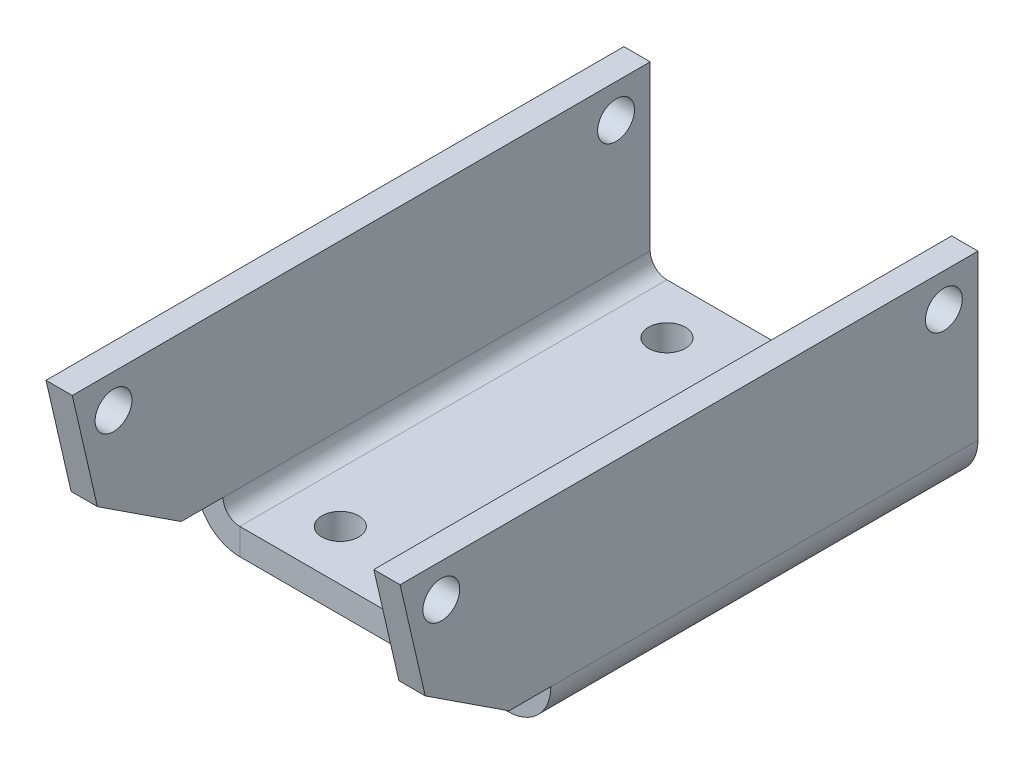
ISO-10303-21;
HEADER;
FILE_DESCRIPTION(('STEP AP214'),'2;1');
FILE_NAME('part.step','',(''),(''),'','','');
FILE_SCHEMA(('AUTOMOTIVE_DESIGN { 1 0 10303 214 1 1 1 1 }'));
ENDSEC;
DATA;
#1=APPLICATION_CONTEXT('core data for automotive mechanical design processes');
#2=APPLICATION_PROTOCOL_DEFINITION('international standard','automotive_design',2000,#1);
#3=PRODUCT_CONTEXT('',#1,'mechanical');
#4=PRODUCT('Part','Part','',(#3));
#5=PRODUCT_RELATED_PRODUCT_CATEGORY('part','',(#4));
#6=PRODUCT_DEFINITION_FORMATION('','',#4);
#7=PRODUCT_DEFINITION_CONTEXT('part definition',#1,'design');
#8=PRODUCT_DEFINITION('design','',#6,#7);
#9=PRODUCT_DEFINITION_SHAPE('','',#8);
#10=(LENGTH_UNIT() NAMED_UNIT(*) SI_UNIT(.MILLI.,.METRE.));
#11=(NAMED_UNIT(*) PLANE_ANGLE_UNIT() SI_UNIT($,.RADIAN.));
#12=(NAMED_UNIT(*) SI_UNIT($,.STERADIAN.) SOLID_ANGLE_UNIT());
#13=UNCERTAINTY_MEASURE_WITH_UNIT(LENGTH_MEASURE(1.E-05),#10,'distance_accuracy_value','');
#14=(GEOMETRIC_REPRESENTATION_CONTEXT(3) GLOBAL_UNCERTAINTY_ASSIGNED_CONTEXT((#13)) GLOBAL_UNIT_ASSIGNED_CONTEXT((#10,
#11,#12)) REPRESENTATION_CONTEXT('',''));
#15=CARTESIAN_POINT('',(0.,0.,0.));
#16=DIRECTION('',(0.,0.,1.));
#17=DIRECTION('',(1.,0.,0.));
#18=AXIS2_PLACEMENT_3D('',#15,#16,#17);
#19=CARTESIAN_POINT('',(-10.57,0.,0.));
#20=DIRECTION('',(-1.,0.,0.));
#21=DIRECTION('',(0.,-1.,0.));
#22=AXIS2_PLACEMENT_3D('',#19,#20,#21);
#23=PLANE('',#22);
#24=CARTESIAN_POINT('',(-10.57,8.77000000000008,-10.7115384615385));
#25=DIRECTION('',(1.,0.,0.));
#26=DIRECTION('',(0.,1.,0.));
#27=AXIS2_PLACEMENT_3D('',#24,#25,#26);
#28=CIRCLE('',#27,1.1);
#29=CARTESIAN_POINT('',(-10.57,9.87000000000008,-10.7115384615385));
#30=VERTEX_POINT('',#29);
#31=EDGE_CURVE('E872',#30,#30,#28,.T.);
#32=ORIENTED_EDGE('',*,*,#31,.T.);
#33=EDGE_LOOP('',(#32));
#34=FACE_BOUND('',#33,.T.);
#35=CARTESIAN_POINT('',(-10.57,8.77000000000008,19.2884615384615));
#36=DIRECTION('',(1.,0.,0.));
#37=DIRECTION('',(0.,1.,0.));
#38=AXIS2_PLACEMENT_3D('',#35,#36,#37);
#39=CIRCLE('',#38,1.1);
#40=CARTESIAN_POINT('',(-10.57,9.87000000000008,19.2884615384615));
#41=VERTEX_POINT('',#40);
#42=EDGE_CURVE('E201',#41,#41,#39,.T.);
#43=ORIENTED_EDGE('',*,*,#42,.T.);
#44=EDGE_LOOP('',(#43));
#45=FACE_BOUND('',#44,.T.);
#46=DIRECTION('',(0.,0.547339555355365,0.836910635099944));
#47=VECTOR('',#46,1.);
#48=CARTESIAN_POINT('',(-10.57,-6.28521358589521,4.11052968517546));
#49=LINE('',#48,#47);
#50=CARTESIAN_POINT('',(-10.57,1.00000000000005,15.25));
#51=VERTEX_POINT('',#50);
#52=CARTESIAN_POINT('',(-10.57,4.27000000000006,20.25));
#53=VERTEX_POINT('',#52);
#54=EDGE_CURVE('E222',#51,#53,#49,.T.);
#55=ORIENTED_EDGE('',*,*,#54,.T.);
#56=DIRECTION('',(0.,0.97439119569462,0.224859506698758));
#57=VECTOR('',#56,1.);
#58=CARTESIAN_POINT('',(-10.57,-4.22089887640452,18.2905617977528));
#59=LINE('',#58,#57);
#60=CARTESIAN_POINT('',(-10.57,10.77,21.75));
#61=VERTEX_POINT('',#60);
#62=EDGE_CURVE('E218',#53,#61,#59,.T.);
#63=ORIENTED_EDGE('',*,*,#62,.T.);
#64=DIRECTION('',(0.,0.,1.));
#65=VECTOR('',#64,1.);
#66=CARTESIAN_POINT('',(-10.57,10.77,12.75));
#67=LINE('',#66,#65);
#68=CARTESIAN_POINT('',(-10.57,10.77,-12.75));
#69=VERTEX_POINT('',#68);
#70=EDGE_CURVE('E276',#69,#61,#67,.T.);
#71=ORIENTED_EDGE('',*,*,#70,.F.);
#72=DIRECTION('',(0.,1.,0.));
#73=VECTOR('',#72,1.);
#74=CARTESIAN_POINT('',(-10.57,10.77,-12.75));
#75=LINE('',#74,#73);
#76=CARTESIAN_POINT('',(-10.57,0.999999999999991,-12.75));
#77=VERTEX_POINT('',#76);
#78=EDGE_CURVE('E279',#77,#69,#75,.T.);
#79=ORIENTED_EDGE('',*,*,#78,.F.);
#80=DIRECTION('',(0.,0.,1.));
#81=VECTOR('',#80,1.);
#82=CARTESIAN_POINT('',(-10.57,0.999999999999991,0.));
#83=LINE('',#82,#81);
#84=CARTESIAN_POINT('',(-10.57,0.999999999999991,12.75));
#85=VERTEX_POINT('',#84);
#86=EDGE_CURVE('E288',#77,#85,#83,.T.);
#87=ORIENTED_EDGE('',*,*,#86,.T.);
#88=DIRECTION('',(0.,0.,-1.));
#89=VECTOR('',#88,1.);
#90=CARTESIAN_POINT('',(-10.57,0.999999999999991,21.75));
#91=LINE('',#90,#89);
#92=EDGE_CURVE('E268',#51,#85,#91,.T.);
#93=ORIENTED_EDGE('',*,*,#92,.F.);
#94=EDGE_LOOP('',(#55,#63,#71,#79,#87,#93));
#95=FACE_BOUND('',#94,.T.);
#96=ADVANCED_FACE('F79',(#34,#45,#95),#23,.T.);
#97=CARTESIAN_POINT('',(-9.,0.,0.));
#98=DIRECTION('',(-1.,0.,0.));
#99=DIRECTION('',(0.,-1.,0.));
#100=AXIS2_PLACEMENT_3D('',#97,#98,#99);
#101=PLANE('',#100);
#102=CARTESIAN_POINT('',(-9.00000000000003,8.77000000000007,-10.7115384615385));
#103=DIRECTION('',(-1.,0.,0.));
#104=DIRECTION('',(0.,-1.,0.));
#105=AXIS2_PLACEMENT_3D('',#102,#103,#104);
#106=CIRCLE('',#105,1.1);
#107=CARTESIAN_POINT('',(-9.00000000000002,7.67000000000007,-10.7115384615385));
#108=VERTEX_POINT('',#107);
#109=EDGE_CURVE('E213',#108,#108,#106,.T.);
#110=ORIENTED_EDGE('',*,*,#109,.T.);
#111=EDGE_LOOP('',(#110));
#112=FACE_BOUND('',#111,.T.);
#113=CARTESIAN_POINT('',(-9.00000000000003,8.77000000000007,19.2884615384615));
#114=DIRECTION('',(-1.,0.,0.));
#115=DIRECTION('',(0.,-1.,0.));
#116=AXIS2_PLACEMENT_3D('',#113,#114,#115);
#117=CIRCLE('',#116,1.1);
#118=CARTESIAN_POINT('',(-9.00000000000002,7.67000000000007,19.2884615384615));
#119=VERTEX_POINT('',#118);
#120=EDGE_CURVE('E200',#119,#119,#117,.T.);
#121=ORIENTED_EDGE('',*,*,#120,.T.);
#122=EDGE_LOOP('',(#121));
#123=FACE_BOUND('',#122,.T.);
#124=DIRECTION('',(0.,0.97439119569462,0.224859506698758));
#125=VECTOR('',#124,1.);
#126=CARTESIAN_POINT('',(-8.99999999999998,-4.22089887640452,18.2905617977528));
#127=LINE('',#126,#125);
#128=CARTESIAN_POINT('',(-9.00000000000002,4.27000000000007,20.25));
#129=VERTEX_POINT('',#128);
#130=CARTESIAN_POINT('',(-9.00000000000004,10.77,21.75));
#131=VERTEX_POINT('',#130);
#132=EDGE_CURVE('E225',#129,#131,#127,.T.);
#133=ORIENTED_EDGE('',*,*,#132,.F.);
#134=DIRECTION('',(0.,0.547339555355365,0.836910635099944));
#135=VECTOR('',#134,1.);
#136=CARTESIAN_POINT('',(-8.99999999999998,-6.28521358589521,4.11052968517546));
#137=LINE('',#136,#135);
#138=CARTESIAN_POINT('',(-9.,1.00000000000006,15.25));
#139=VERTEX_POINT('',#138);
#140=EDGE_CURVE('E205',#139,#129,#137,.T.);
#141=ORIENTED_EDGE('',*,*,#140,.F.);
#142=DIRECTION('',(0.,0.,-1.));
#143=VECTOR('',#142,1.);
#144=CARTESIAN_POINT('',(-9.,0.999999999999997,21.75));
#145=LINE('',#144,#143);
#146=CARTESIAN_POINT('',(-9.,0.999999999999997,12.75));
#147=VERTEX_POINT('',#146);
#148=EDGE_CURVE('E265',#139,#147,#145,.T.);
#149=ORIENTED_EDGE('',*,*,#148,.T.);
#150=DIRECTION('',(0.,0.,-1.));
#151=VECTOR('',#150,1.);
#152=CARTESIAN_POINT('',(-9.,0.999999999999997,-12.75));
#153=LINE('',#152,#151);
#154=CARTESIAN_POINT('',(-9.,0.999999999999997,-12.75));
#155=VERTEX_POINT('',#154);
#156=EDGE_CURVE('E294',#155,#147,#153,.F.);
#157=ORIENTED_EDGE('',*,*,#156,.F.);
#158=DIRECTION('',(0.,-1.,0.));
#159=VECTOR('',#158,1.);
#160=CARTESIAN_POINT('',(-9.,0.,-12.75));
#161=LINE('',#160,#159);
#162=CARTESIAN_POINT('',(-9.00000000000004,10.77,-12.75));
#163=VERTEX_POINT('',#162);
#164=EDGE_CURVE('E285',#155,#163,#161,.F.);
#165=ORIENTED_EDGE('',*,*,#164,.T.);
#166=DIRECTION('',(0.,0.,-1.));
#167=VECTOR('',#166,1.);
#168=CARTESIAN_POINT('',(-9.00000000000004,10.77,0.));
#169=LINE('',#168,#167);
#170=EDGE_CURVE('E282',#163,#131,#169,.F.);
#171=ORIENTED_EDGE('',*,*,#170,.T.);
#172=EDGE_LOOP('',(#133,#141,#149,#157,#165,#171));
#173=FACE_BOUND('',#172,.T.);
#174=ADVANCED_FACE('F416',(#112,#123,#173),#101,.F.);
#175=CARTESIAN_POINT('',(-10.57,0.999999999999991,21.75));
#176=DIRECTION('',(0.,1.,0.));
#177=DIRECTION('',(-1.,0.,0.));
#178=AXIS2_PLACEMENT_3D('',#175,#176,#177);
#179=PLANE('',#178);
#180=DIRECTION('',(1.,0.,0.));
#181=VECTOR('',#180,1.);
#182=CARTESIAN_POINT('',(-9.,1.00000000000006,15.25));
#183=LINE('',#182,#181);
#184=EDGE_CURVE('E221',#139,#51,#183,.F.);
#185=ORIENTED_EDGE('',*,*,#184,.T.);
#186=ORIENTED_EDGE('',*,*,#92,.T.);
#187=DIRECTION('',(-1.,0.,0.));
#188=VECTOR('',#187,1.);
#189=CARTESIAN_POINT('',(-9.,0.999999999999997,12.75));
#190=LINE('',#189,#188);
#191=EDGE_CURVE('E291',#147,#85,#190,.T.);
#192=ORIENTED_EDGE('',*,*,#191,.F.);
#193=ORIENTED_EDGE('',*,*,#148,.F.);
#194=EDGE_LOOP('',(#185,#186,#192,#193));
#195=FACE_BOUND('',#194,.T.);
#196=ADVANCED_FACE('F422',(#195),#179,.F.);
#197=CARTESIAN_POINT('',(10.57,0.,0.));
#198=DIRECTION('',(-1.,0.,0.));
#199=DIRECTION('',(0.,-1.,0.));
#200=AXIS2_PLACEMENT_3D('',#197,#198,#199);
#201=PLANE('',#200);
#202=CARTESIAN_POINT('',(10.57,8.77,-10.7115384615385));
#203=DIRECTION('',(1.,0.,0.));
#204=DIRECTION('',(0.,1.,0.));
#205=AXIS2_PLACEMENT_3D('',#202,#203,#204);
#206=CIRCLE('',#205,1.1);
#207=CARTESIAN_POINT('',(10.57,9.87,-10.7115384615385));
#208=VERTEX_POINT('',#207);
#209=EDGE_CURVE('E877',#208,#208,#206,.T.);
#210=ORIENTED_EDGE('',*,*,#209,.F.);
#211=EDGE_LOOP('',(#210));
#212=FACE_BOUND('',#211,.T.);
#213=CARTESIAN_POINT('',(10.57,8.77,19.2884615384615));
#214=DIRECTION('',(1.,0.,0.));
#215=DIRECTION('',(0.,1.,0.));
#216=AXIS2_PLACEMENT_3D('',#213,#214,#215);
#217=CIRCLE('',#216,1.1);
#218=CARTESIAN_POINT('',(10.57,9.87,19.2884615384615));
#219=VERTEX_POINT('',#218);
#220=EDGE_CURVE('E208',#219,#219,#217,.T.);
#221=ORIENTED_EDGE('',*,*,#220,.F.);
#222=EDGE_LOOP('',(#221));
#223=FACE_BOUND('',#222,.T.);
#224=DIRECTION('',(0.,0.97439119569462,0.224859506698758));
#225=VECTOR('',#224,1.);
#226=CARTESIAN_POINT('',(10.57,-4.22089887640452,18.2905617977528));
#227=LINE('',#226,#225);
#228=CARTESIAN_POINT('',(10.57,4.27,20.25));
#229=VERTEX_POINT('',#228);
#230=CARTESIAN_POINT('',(10.57,10.77,21.75));
#231=VERTEX_POINT('',#230);
#232=EDGE_CURVE('E236',#229,#231,#227,.T.);
#233=ORIENTED_EDGE('',*,*,#232,.F.);
#234=DIRECTION('',(0.,0.547339555355365,0.836910635099944));
#235=VECTOR('',#234,1.);
#236=CARTESIAN_POINT('',(10.57,-6.28521358589526,4.11052968517548));
#237=LINE('',#236,#235);
#238=CARTESIAN_POINT('',(10.57,0.999999999999991,15.25));
#239=VERTEX_POINT('',#238);
#240=EDGE_CURVE('E239',#239,#229,#237,.T.);
#241=ORIENTED_EDGE('',*,*,#240,.F.);
#242=DIRECTION('',(0.,0.,-1.));
#243=VECTOR('',#242,1.);
#244=CARTESIAN_POINT('',(10.57,0.999999999999991,21.75));
#245=LINE('',#244,#243);
#246=CARTESIAN_POINT('',(10.57,0.999999999999991,12.75));
#247=VERTEX_POINT('',#246);
#248=EDGE_CURVE('E256',#239,#247,#245,.T.);
#249=ORIENTED_EDGE('',*,*,#248,.T.);
#250=DIRECTION('',(0.,0.,-1.));
#251=VECTOR('',#250,1.);
#252=CARTESIAN_POINT('',(10.57,0.999999999999991,12.75));
#253=LINE('',#252,#251);
#254=CARTESIAN_POINT('',(10.57,0.999999999999991,-12.75));
#255=VERTEX_POINT('',#254);
#256=EDGE_CURVE('E324',#255,#247,#253,.F.);
#257=ORIENTED_EDGE('',*,*,#256,.F.);
#258=DIRECTION('',(0.,1.,0.));
#259=VECTOR('',#258,1.);
#260=CARTESIAN_POINT('',(10.57,0.,-12.75));
#261=LINE('',#260,#259);
#262=CARTESIAN_POINT('',(10.57,10.77,-12.75));
#263=VERTEX_POINT('',#262);
#264=EDGE_CURVE('E315',#255,#263,#261,.T.);
#265=ORIENTED_EDGE('',*,*,#264,.T.);
#266=DIRECTION('',(0.,0.,1.));
#267=VECTOR('',#266,1.);
#268=CARTESIAN_POINT('',(10.57,10.77,0.));
#269=LINE('',#268,#267);
#270=EDGE_CURVE('E312',#263,#231,#269,.T.);
#271=ORIENTED_EDGE('',*,*,#270,.T.);
#272=EDGE_LOOP('',(#233,#241,#249,#257,#265,#271));
#273=FACE_BOUND('',#272,.T.);
#274=ADVANCED_FACE('F403',(#212,#223,#273),#201,.F.);
#275=CARTESIAN_POINT('',(9.,0.,0.));
#276=DIRECTION('',(-1.,0.,0.));
#277=DIRECTION('',(0.,-1.,0.));
#278=AXIS2_PLACEMENT_3D('',#275,#276,#277);
#279=PLANE('',#278);
#280=CARTESIAN_POINT('',(9.00000000000003,8.77000000000001,-10.7115384615385));
#281=DIRECTION('',(-1.,0.,0.));
#282=DIRECTION('',(0.,-1.,0.));
#283=AXIS2_PLACEMENT_3D('',#280,#281,#282);
#284=CIRCLE('',#283,1.1);
#285=CARTESIAN_POINT('',(9.00000000000002,7.67000000000001,-10.7115384615385));
#286=VERTEX_POINT('',#285);
#287=EDGE_CURVE('E83',#286,#286,#284,.T.);
#288=ORIENTED_EDGE('',*,*,#287,.F.);
#289=EDGE_LOOP('',(#288));
#290=FACE_BOUND('',#289,.T.);
#291=CARTESIAN_POINT('',(9.00000000000003,8.77000000000001,19.2884615384615));
#292=DIRECTION('',(-1.,0.,0.));
#293=DIRECTION('',(0.,-1.,0.));
#294=AXIS2_PLACEMENT_3D('',#291,#292,#293);
#295=CIRCLE('',#294,1.1);
#296=CARTESIAN_POINT('',(9.00000000000002,7.67000000000001,19.2884615384615));
#297=VERTEX_POINT('',#296);
#298=EDGE_CURVE('E198',#297,#297,#295,.T.);
#299=ORIENTED_EDGE('',*,*,#298,.F.);
#300=EDGE_LOOP('',(#299));
#301=FACE_BOUND('',#300,.T.);
#302=DIRECTION('',(0.,0.547339555355365,0.836910635099944));
#303=VECTOR('',#302,1.);
#304=CARTESIAN_POINT('',(8.99999999999998,-6.28521358589525,4.11052968517548));
#305=LINE('',#304,#303);
#306=CARTESIAN_POINT('',(9.,0.999999999999996,15.25));
#307=VERTEX_POINT('',#306);
#308=CARTESIAN_POINT('',(9.00000000000002,4.27000000000001,20.25));
#309=VERTEX_POINT('',#308);
#310=EDGE_CURVE('E240',#307,#309,#305,.T.);
#311=ORIENTED_EDGE('',*,*,#310,.T.);
#312=DIRECTION('',(0.,0.97439119569462,0.224859506698758));
#313=VECTOR('',#312,1.);
#314=CARTESIAN_POINT('',(8.99999999999998,-4.22089887640452,18.2905617977528));
#315=LINE('',#314,#313);
#316=CARTESIAN_POINT('',(9.00000000000004,10.77,21.75));
#317=VERTEX_POINT('',#316);
#318=EDGE_CURVE('E233',#309,#317,#315,.T.);
#319=ORIENTED_EDGE('',*,*,#318,.T.);
#320=DIRECTION('',(0.,0.,-1.));
#321=VECTOR('',#320,1.);
#322=CARTESIAN_POINT('',(9.00000000000004,10.77,12.75));
#323=LINE('',#322,#321);
#324=CARTESIAN_POINT('',(9.00000000000004,10.77,-12.75));
#325=VERTEX_POINT('',#324);
#326=EDGE_CURVE('E318',#325,#317,#323,.F.);
#327=ORIENTED_EDGE('',*,*,#326,.F.);
#328=DIRECTION('',(0.,-1.,0.));
#329=VECTOR('',#328,1.);
#330=CARTESIAN_POINT('',(9.00000000000004,10.77,-12.75));
#331=LINE('',#330,#329);
#332=CARTESIAN_POINT('',(9.,0.999999999999997,-12.75));
#333=VERTEX_POINT('',#332);
#334=EDGE_CURVE('E321',#333,#325,#331,.F.);
#335=ORIENTED_EDGE('',*,*,#334,.F.);
#336=DIRECTION('',(0.,0.,-1.));
#337=VECTOR('',#336,1.);
#338=CARTESIAN_POINT('',(9.,0.999999999999997,12.75));
#339=LINE('',#338,#337);
#340=CARTESIAN_POINT('',(9.,0.999999999999997,12.75));
#341=VERTEX_POINT('',#340);
#342=EDGE_CURVE('E330',#341,#333,#339,.T.);
#343=ORIENTED_EDGE('',*,*,#342,.F.);
#344=DIRECTION('',(0.,0.,-1.));
#345=VECTOR('',#344,1.);
#346=CARTESIAN_POINT('',(9.,0.999999999999997,21.75));
#347=LINE('',#346,#345);
#348=EDGE_CURVE('E259',#307,#341,#347,.T.);
#349=ORIENTED_EDGE('',*,*,#348,.F.);
#350=EDGE_LOOP('',(#311,#319,#327,#335,#343,#349));
#351=FACE_BOUND('',#350,.T.);
#352=ADVANCED_FACE('F346',(#290,#301,#351),#279,.T.);
#353=CARTESIAN_POINT('',(10.57,0.999999999999991,21.75));
#354=DIRECTION('',(0.,1.,0.));
#355=DIRECTION('',(-1.,0.,0.));
#356=AXIS2_PLACEMENT_3D('',#353,#354,#355);
#357=PLANE('',#356);
#358=DIRECTION('',(-1.,0.,0.));
#359=VECTOR('',#358,1.);
#360=CARTESIAN_POINT('',(9.,0.999999999999996,15.25));
#361=LINE('',#360,#359);
#362=EDGE_CURVE('E248',#307,#239,#361,.F.);
#363=ORIENTED_EDGE('',*,*,#362,.F.);
#364=ORIENTED_EDGE('',*,*,#348,.T.);
#365=DIRECTION('',(-1.,0.,0.));
#366=VECTOR('',#365,1.);
#367=CARTESIAN_POINT('',(10.57,0.999999999999991,12.75));
#368=LINE('',#367,#366);
#369=EDGE_CURVE('E151',#341,#247,#368,.F.);
#370=ORIENTED_EDGE('',*,*,#369,.T.);
#371=ORIENTED_EDGE('',*,*,#248,.F.);
#372=EDGE_LOOP('',(#363,#364,#370,#371));
#373=FACE_BOUND('',#372,.T.);
#374=ADVANCED_FACE('F339',(#373),#357,.F.);
#375=CARTESIAN_POINT('',(-8.,-1.57,12.75));
#376=DIRECTION('',(0.,0.,1.));
#377=DIRECTION('',(1.,0.,0.));
#378=AXIS2_PLACEMENT_3D('',#375,#376,#377);
#379=PLANE('',#378);
#380=DIRECTION('',(1.,0.,0.));
#381=VECTOR('',#380,1.);
#382=CARTESIAN_POINT('',(-8.,0.,12.75));
#383=LINE('',#382,#381);
#384=CARTESIAN_POINT('',(-8.,0.,12.75));
#385=VERTEX_POINT('',#384);
#386=CARTESIAN_POINT('',(8.,0.,12.75));
#387=VERTEX_POINT('',#386);
#388=EDGE_CURVE('E122',#385,#387,#383,.T.);
#389=ORIENTED_EDGE('',*,*,#388,.F.);
#390=DIRECTION('',(0.,1.,0.));
#391=VECTOR('',#390,1.);
#392=CARTESIAN_POINT('',(-8.,-1.57,12.75));
#393=LINE('',#392,#391);
#394=CARTESIAN_POINT('',(-8.,-1.57,12.75));
#395=VERTEX_POINT('',#394);
#396=EDGE_CURVE('E89',#395,#385,#393,.T.);
#397=ORIENTED_EDGE('',*,*,#396,.F.);
#398=DIRECTION('',(1.,0.,0.));
#399=VECTOR('',#398,1.);
#400=CARTESIAN_POINT('',(-8.,-1.57,12.75));
#401=LINE('',#400,#399);
#402=CARTESIAN_POINT('',(8.,-1.57,12.75));
#403=VERTEX_POINT('',#402);
#404=EDGE_CURVE('E124',#395,#403,#401,.T.);
#405=ORIENTED_EDGE('',*,*,#404,.T.);
#406=DIRECTION('',(0.,1.,0.));
#407=VECTOR('',#406,1.);
#408=CARTESIAN_POINT('',(8.,-1.57,12.75));
#409=LINE('',#408,#407);
#410=EDGE_CURVE('E13',#403,#387,#409,.T.);
#411=ORIENTED_EDGE('',*,*,#410,.T.);
#412=EDGE_LOOP('',(#389,#397,#405,#411));
#413=FACE_BOUND('',#412,.T.);
#414=ADVANCED_FACE('F120',(#413),#379,.T.);
#415=CARTESIAN_POINT('',(-8.,-1.57,-12.75));
#416=DIRECTION('',(0.,0.,-1.));
#417=DIRECTION('',(-1.,0.,0.));
#418=AXIS2_PLACEMENT_3D('',#415,#416,#417);
#419=PLANE('',#418);
#420=DIRECTION('',(-1.,0.,0.));
#421=VECTOR('',#420,1.);
#422=CARTESIAN_POINT('',(-8.,0.,-12.75));
#423=LINE('',#422,#421);
#424=CARTESIAN_POINT('',(8.,0.,-12.75));
#425=VERTEX_POINT('',#424);
#426=CARTESIAN_POINT('',(-8.,0.,-12.75));
#427=VERTEX_POINT('',#426);
#428=EDGE_CURVE('E145',#425,#427,#423,.T.);
#429=ORIENTED_EDGE('',*,*,#428,.F.);
#430=DIRECTION('',(0.,1.,0.));
#431=VECTOR('',#430,1.);
#432=CARTESIAN_POINT('',(8.,-1.57,-12.75));
#433=LINE('',#432,#431);
#434=CARTESIAN_POINT('',(8.,-1.57,-12.75));
#435=VERTEX_POINT('',#434);
#436=EDGE_CURVE('E191',#435,#425,#433,.T.);
#437=ORIENTED_EDGE('',*,*,#436,.F.);
#438=DIRECTION('',(-1.,0.,0.));
#439=VECTOR('',#438,1.);
#440=CARTESIAN_POINT('',(-8.,-1.57,-12.75));
#441=LINE('',#440,#439);
#442=CARTESIAN_POINT('',(-8.,-1.57,-12.75));
#443=VERTEX_POINT('',#442);
#444=EDGE_CURVE('E185',#435,#443,#441,.T.);
#445=ORIENTED_EDGE('',*,*,#444,.T.);
#446=DIRECTION('',(0.,1.,0.));
#447=VECTOR('',#446,1.);
#448=CARTESIAN_POINT('',(-8.,-1.57,-12.75));
#449=LINE('',#448,#447);
#450=EDGE_CURVE('E196',#443,#427,#449,.T.);
#451=ORIENTED_EDGE('',*,*,#450,.T.);
#452=EDGE_LOOP('',(#429,#437,#445,#451));
#453=FACE_BOUND('',#452,.T.);
#454=ADVANCED_FACE('F81',(#453),#419,.T.);
#455=CARTESIAN_POINT('',(0.,-1.57,0.));
#456=DIRECTION('',(0.,-1.,0.));
#457=DIRECTION('',(0.,0.,-1.));
#458=AXIS2_PLACEMENT_3D('',#455,#456,#457);
#459=PLANE('',#458);
#460=CARTESIAN_POINT('',(5.,-1.57,9.75));
#461=DIRECTION('',(0.,1.,0.));
#462=DIRECTION('',(0.,0.,1.));
#463=AXIS2_PLACEMENT_3D('',#460,#461,#462);
#464=CIRCLE('',#463,1.1);
#465=CARTESIAN_POINT('',(5.,-1.57,10.85));
#466=VERTEX_POINT('',#465);
#467=EDGE_CURVE('E161',#466,#466,#464,.T.);
#468=ORIENTED_EDGE('',*,*,#467,.T.);
#469=EDGE_LOOP('',(#468));
#470=FACE_BOUND('',#469,.T.);
#471=CARTESIAN_POINT('',(-5.,-1.57,9.75));
#472=DIRECTION('',(0.,1.,0.));
#473=DIRECTION('',(0.,0.,1.));
#474=AXIS2_PLACEMENT_3D('',#471,#472,#473);
#475=CIRCLE('',#474,1.1);
#476=CARTESIAN_POINT('',(-5.,-1.57,10.85));
#477=VERTEX_POINT('',#476);
#478=EDGE_CURVE('E168',#477,#477,#475,.T.);
#479=ORIENTED_EDGE('',*,*,#478,.T.);
#480=EDGE_LOOP('',(#479));
#481=FACE_BOUND('',#480,.T.);
#482=CARTESIAN_POINT('',(5.,-1.57,-9.75));
#483=DIRECTION('',(0.,1.,0.));
#484=DIRECTION('',(0.,0.,1.));
#485=AXIS2_PLACEMENT_3D('',#482,#483,#484);
#486=CIRCLE('',#485,1.1);
#487=CARTESIAN_POINT('',(5.,-1.57,-8.65));
#488=VERTEX_POINT('',#487);
#489=EDGE_CURVE('E174',#488,#488,#486,.T.);
#490=ORIENTED_EDGE('',*,*,#489,.T.);
#491=EDGE_LOOP('',(#490));
#492=FACE_BOUND('',#491,.T.);
#493=CARTESIAN_POINT('',(-5.,-1.57,-9.75));
#494=DIRECTION('',(0.,1.,0.));
#495=DIRECTION('',(0.,0.,1.));
#496=AXIS2_PLACEMENT_3D('',#493,#494,#495);
#497=CIRCLE('',#496,1.1);
#498=CARTESIAN_POINT('',(-5.,-1.57,-8.65));
#499=VERTEX_POINT('',#498);
#500=EDGE_CURVE('E146',#499,#499,#497,.T.);
#501=ORIENTED_EDGE('',*,*,#500,.T.);
#502=EDGE_LOOP('',(#501));
#503=FACE_BOUND('',#502,.T.);
#504=DIRECTION('',(0.,0.,-1.));
#505=VECTOR('',#504,1.);
#506=CARTESIAN_POINT('',(8.,-1.57,12.75));
#507=LINE('',#506,#505);
#508=EDGE_CURVE('E98',#403,#435,#507,.T.);
#509=ORIENTED_EDGE('',*,*,#508,.F.);
#510=ORIENTED_EDGE('',*,*,#404,.F.);
#511=DIRECTION('',(0.,0.,1.));
#512=VECTOR('',#511,1.);
#513=CARTESIAN_POINT('',(-8.,-1.57,12.75));
#514=LINE('',#513,#512);
#515=EDGE_CURVE('E188',#443,#395,#514,.T.);
#516=ORIENTED_EDGE('',*,*,#515,.F.);
#517=ORIENTED_EDGE('',*,*,#444,.F.);
#518=EDGE_LOOP('',(#509,#510,#516,#517));
#519=FACE_BOUND('',#518,.T.);
#520=ADVANCED_FACE('F735',(#470,#481,#492,#503,#519),#459,.T.);
#521=CARTESIAN_POINT('',(0.,0.,0.));
#522=DIRECTION('',(0.,-1.,0.));
#523=DIRECTION('',(0.,0.,-1.));
#524=AXIS2_PLACEMENT_3D('',#521,#522,#523);
#525=PLANE('',#524);
#526=CARTESIAN_POINT('',(5.,0.,9.75));
#527=DIRECTION('',(0.,1.,0.));
#528=DIRECTION('',(0.,0.,1.));
#529=AXIS2_PLACEMENT_3D('',#526,#527,#528);
#530=CIRCLE('',#529,1.1);
#531=CARTESIAN_POINT('',(5.,0.,10.85));
#532=VERTEX_POINT('',#531);
#533=EDGE_CURVE('E165',#532,#532,#530,.T.);
#534=ORIENTED_EDGE('',*,*,#533,.F.);
#535=EDGE_LOOP('',(#534));
#536=FACE_BOUND('',#535,.T.);
#537=CARTESIAN_POINT('',(-5.,0.,9.75));
#538=DIRECTION('',(0.,1.,0.));
#539=DIRECTION('',(0.,0.,1.));
#540=AXIS2_PLACEMENT_3D('',#537,#538,#539);
#541=CIRCLE('',#540,1.1);
#542=CARTESIAN_POINT('',(-5.,0.,10.85));
#543=VERTEX_POINT('',#542);
#544=EDGE_CURVE('E164',#543,#543,#541,.T.);
#545=ORIENTED_EDGE('',*,*,#544,.F.);
#546=EDGE_LOOP('',(#545));
#547=FACE_BOUND('',#546,.T.);
#548=CARTESIAN_POINT('',(5.,0.,-9.75));
#549=DIRECTION('',(0.,1.,0.));
#550=DIRECTION('',(0.,0.,1.));
#551=AXIS2_PLACEMENT_3D('',#548,#549,#550);
#552=CIRCLE('',#551,1.1);
#553=CARTESIAN_POINT('',(5.,0.,-8.65));
#554=VERTEX_POINT('',#553);
#555=EDGE_CURVE('E171',#554,#554,#552,.T.);
#556=ORIENTED_EDGE('',*,*,#555,.F.);
#557=EDGE_LOOP('',(#556));
#558=FACE_BOUND('',#557,.T.);
#559=CARTESIAN_POINT('',(-5.,0.,-9.75));
#560=DIRECTION('',(0.,1.,0.));
#561=DIRECTION('',(0.,0.,1.));
#562=AXIS2_PLACEMENT_3D('',#559,#560,#561);
#563=CIRCLE('',#562,1.1);
#564=CARTESIAN_POINT('',(-5.,0.,-8.65));
#565=VERTEX_POINT('',#564);
#566=EDGE_CURVE('E177',#565,#565,#563,.T.);
#567=ORIENTED_EDGE('',*,*,#566,.F.);
#568=EDGE_LOOP('',(#567));
#569=FACE_BOUND('',#568,.T.);
#570=DIRECTION('',(0.,0.,-1.));
#571=VECTOR('',#570,1.);
#572=CARTESIAN_POINT('',(8.,0.,12.75));
#573=LINE('',#572,#571);
#574=EDGE_CURVE('E132',#387,#425,#573,.T.);
#575=ORIENTED_EDGE('',*,*,#574,.T.);
#576=ORIENTED_EDGE('',*,*,#428,.T.);
#577=DIRECTION('',(0.,0.,1.));
#578=VECTOR('',#577,1.);
#579=CARTESIAN_POINT('',(-8.,0.,12.75));
#580=LINE('',#579,#578);
#581=EDGE_CURVE('E116',#427,#385,#580,.T.);
#582=ORIENTED_EDGE('',*,*,#581,.T.);
#583=ORIENTED_EDGE('',*,*,#388,.T.);
#584=EDGE_LOOP('',(#575,#576,#582,#583));
#585=FACE_BOUND('',#584,.T.);
#586=ADVANCED_FACE('F131',(#536,#547,#558,#569,#585),#525,.F.);
#587=CARTESIAN_POINT('',(-5.,-1.57,-9.75));
#588=DIRECTION('',(0.,1.,0.));
#589=DIRECTION('',(0.,0.,1.));
#590=AXIS2_PLACEMENT_3D('',#587,#588,#589);
#591=CYLINDRICAL_SURFACE('',#590,1.1);
#592=ORIENTED_EDGE('',*,*,#500,.F.);
#593=EDGE_LOOP('',(#592));
#594=FACE_BOUND('',#593,.T.);
#595=ORIENTED_EDGE('',*,*,#566,.T.);
#596=EDGE_LOOP('',(#595));
#597=FACE_BOUND('',#596,.T.);
#598=ADVANCED_FACE('F716',(#594,#597),#591,.F.);
#599=CARTESIAN_POINT('',(5.,-1.57,-9.75));
#600=DIRECTION('',(0.,1.,0.));
#601=DIRECTION('',(0.,0.,1.));
#602=AXIS2_PLACEMENT_3D('',#599,#600,#601);
#603=CYLINDRICAL_SURFACE('',#602,1.1);
#604=ORIENTED_EDGE('',*,*,#489,.F.);
#605=EDGE_LOOP('',(#604));
#606=FACE_BOUND('',#605,.T.);
#607=ORIENTED_EDGE('',*,*,#555,.T.);
#608=EDGE_LOOP('',(#607));
#609=FACE_BOUND('',#608,.T.);
#610=ADVANCED_FACE('F706',(#606,#609),#603,.F.);
#611=CARTESIAN_POINT('',(-5.,-1.57,9.75));
#612=DIRECTION('',(0.,1.,0.));
#613=DIRECTION('',(0.,0.,1.));
#614=AXIS2_PLACEMENT_3D('',#611,#612,#613);
#615=CYLINDRICAL_SURFACE('',#614,1.1);
#616=ORIENTED_EDGE('',*,*,#478,.F.);
#617=EDGE_LOOP('',(#616));
#618=FACE_BOUND('',#617,.T.);
#619=ORIENTED_EDGE('',*,*,#544,.T.);
#620=EDGE_LOOP('',(#619));
#621=FACE_BOUND('',#620,.T.);
#622=ADVANCED_FACE('F696',(#618,#621),#615,.F.);
#623=CARTESIAN_POINT('',(5.,-1.57,9.75));
#624=DIRECTION('',(0.,1.,0.));
#625=DIRECTION('',(0.,0.,1.));
#626=AXIS2_PLACEMENT_3D('',#623,#624,#625);
#627=CYLINDRICAL_SURFACE('',#626,1.1);
#628=ORIENTED_EDGE('',*,*,#467,.F.);
#629=EDGE_LOOP('',(#628));
#630=FACE_BOUND('',#629,.T.);
#631=ORIENTED_EDGE('',*,*,#533,.T.);
#632=EDGE_LOOP('',(#631));
#633=FACE_BOUND('',#632,.T.);
#634=ADVANCED_FACE('F688',(#630,#633),#627,.F.);
#635=CARTESIAN_POINT('',(8.,1.,12.75));
#636=DIRECTION('',(0.,0.,1.));
#637=DIRECTION('',(1.,0.,0.));
#638=AXIS2_PLACEMENT_3D('',#635,#636,#637);
#639=PLANE('',#638);
#640=ORIENTED_EDGE('',*,*,#369,.F.);
#641=CARTESIAN_POINT('',(8.,1.,12.75));
#642=DIRECTION('',(0.,0.,-1.));
#643=DIRECTION('',(-1.,0.,0.));
#644=AXIS2_PLACEMENT_3D('',#641,#642,#643);
#645=CIRCLE('',#644,1.);
#646=EDGE_CURVE('E141',#387,#341,#645,.F.);
#647=ORIENTED_EDGE('',*,*,#646,.F.);
#648=ORIENTED_EDGE('',*,*,#410,.F.);
#649=CARTESIAN_POINT('',(8.,1.,12.75));
#650=DIRECTION('',(0.,0.,-1.));
#651=DIRECTION('',(-1.,0.,0.));
#652=AXIS2_PLACEMENT_3D('',#649,#650,#651);
#653=CIRCLE('',#652,2.57);
#654=EDGE_CURVE('E155',#403,#247,#653,.F.);
#655=ORIENTED_EDGE('',*,*,#654,.T.);
#656=EDGE_LOOP('',(#640,#647,#648,#655));
#657=FACE_BOUND('',#656,.T.);
#658=ADVANCED_FACE('F149',(#657),#639,.T.);
#659=CARTESIAN_POINT('',(8.,1.,-12.75));
#660=DIRECTION('',(0.,0.,1.));
#661=DIRECTION('',(1.,0.,0.));
#662=AXIS2_PLACEMENT_3D('',#659,#660,#661);
#663=PLANE('',#662);
#664=CARTESIAN_POINT('',(8.,1.,-12.75));
#665=DIRECTION('',(0.,0.,-1.));
#666=DIRECTION('',(-1.,0.,0.));
#667=AXIS2_PLACEMENT_3D('',#664,#665,#666);
#668=CIRCLE('',#667,1.);
#669=EDGE_CURVE('E144',#333,#425,#668,.T.);
#670=ORIENTED_EDGE('',*,*,#669,.F.);
#671=DIRECTION('',(-1.,0.,0.));
#672=VECTOR('',#671,1.);
#673=CARTESIAN_POINT('',(9.,0.999999999999997,-12.75));
#674=LINE('',#673,#672);
#675=EDGE_CURVE('E327',#333,#255,#674,.F.);
#676=ORIENTED_EDGE('',*,*,#675,.T.);
#677=CARTESIAN_POINT('',(8.,1.,-12.75));
#678=DIRECTION('',(0.,0.,-1.));
#679=DIRECTION('',(-1.,0.,0.));
#680=AXIS2_PLACEMENT_3D('',#677,#678,#679);
#681=CIRCLE('',#680,2.57);
#682=EDGE_CURVE('E152',#255,#435,#681,.T.);
#683=ORIENTED_EDGE('',*,*,#682,.T.);
#684=ORIENTED_EDGE('',*,*,#436,.T.);
#685=EDGE_LOOP('',(#670,#676,#683,#684));
#686=FACE_BOUND('',#685,.T.);
#687=ADVANCED_FACE('F389',(#686),#663,.F.);
#688=CARTESIAN_POINT('',(8.,1.,-12.75));
#689=DIRECTION('',(0.,0.,-1.));
#690=DIRECTION('',(1.,0.,0.));
#691=AXIS2_PLACEMENT_3D('',#688,#689,#690);
#692=CYLINDRICAL_SURFACE('',#691,2.57);
#693=ORIENTED_EDGE('',*,*,#508,.T.);
#694=ORIENTED_EDGE('',*,*,#682,.F.);
#695=ORIENTED_EDGE('',*,*,#256,.T.);
#696=ORIENTED_EDGE('',*,*,#654,.F.);
#697=EDGE_LOOP('',(#693,#694,#695,#696));
#698=FACE_BOUND('',#697,.T.);
#699=ADVANCED_FACE('F405',(#698),#692,.T.);
#700=CARTESIAN_POINT('',(8.,1.,-12.75));
#701=DIRECTION('',(0.,0.,-1.));
#702=DIRECTION('',(1.,0.,0.));
#703=AXIS2_PLACEMENT_3D('',#700,#701,#702);
#704=CYLINDRICAL_SURFACE('',#703,1.);
#705=ORIENTED_EDGE('',*,*,#574,.F.);
#706=ORIENTED_EDGE('',*,*,#646,.T.);
#707=ORIENTED_EDGE('',*,*,#342,.T.);
#708=ORIENTED_EDGE('',*,*,#669,.T.);
#709=EDGE_LOOP('',(#705,#706,#707,#708));
#710=FACE_BOUND('',#709,.T.);
#711=ADVANCED_FACE('F138',(#710),#704,.F.);
#712=CARTESIAN_POINT('',(10.57,10.77,-12.75));
#713=DIRECTION('',(0.,0.,1.));
#714=DIRECTION('',(1.,0.,0.));
#715=AXIS2_PLACEMENT_3D('',#712,#713,#714);
#716=PLANE('',#715);
#717=ORIENTED_EDGE('',*,*,#675,.F.);
#718=ORIENTED_EDGE('',*,*,#334,.T.);
#719=DIRECTION('',(-1.,0.,0.));
#720=VECTOR('',#719,1.);
#721=CARTESIAN_POINT('',(10.57,10.77,-12.75));
#722=LINE('',#721,#720);
#723=EDGE_CURVE('E157',#263,#325,#722,.T.);
#724=ORIENTED_EDGE('',*,*,#723,.F.);
#725=ORIENTED_EDGE('',*,*,#264,.F.);
#726=EDGE_LOOP('',(#717,#718,#724,#725));
#727=FACE_BOUND('',#726,.T.);
#728=ADVANCED_FACE('F394',(#727),#716,.F.);
#729=CARTESIAN_POINT('',(10.57,10.77,12.75));
#730=DIRECTION('',(0.,-1.,0.));
#731=DIRECTION('',(1.,0.,0.));
#732=AXIS2_PLACEMENT_3D('',#729,#730,#731);
#733=PLANE('',#732);
#734=ORIENTED_EDGE('',*,*,#326,.T.);
#735=DIRECTION('',(-1.,0.,0.));
#736=VECTOR('',#735,1.);
#737=CARTESIAN_POINT('',(9.00000000000004,10.77,21.75));
#738=LINE('',#737,#736);
#739=EDGE_CURVE('E251',#231,#317,#738,.T.);
#740=ORIENTED_EDGE('',*,*,#739,.F.);
#741=ORIENTED_EDGE('',*,*,#270,.F.);
#742=ORIENTED_EDGE('',*,*,#723,.T.);
#743=EDGE_LOOP('',(#734,#740,#741,#742));
#744=FACE_BOUND('',#743,.T.);
#745=ADVANCED_FACE('F399',(#744),#733,.F.);
#746=CARTESIAN_POINT('',(-8.,1.,-12.75));
#747=DIRECTION('',(0.,0.,-1.));
#748=DIRECTION('',(-1.,0.,0.));
#749=AXIS2_PLACEMENT_3D('',#746,#747,#748);
#750=PLANE('',#749);
#751=DIRECTION('',(-1.,0.,0.));
#752=VECTOR('',#751,1.);
#753=CARTESIAN_POINT('',(-10.57,0.99999999999999,-12.75));
#754=LINE('',#753,#752);
#755=EDGE_CURVE('E271',#155,#77,#754,.T.);
#756=ORIENTED_EDGE('',*,*,#755,.F.);
#757=CARTESIAN_POINT('',(-8.,1.,-12.75));
#758=DIRECTION('',(0.,0.,1.));
#759=DIRECTION('',(1.,0.,0.));
#760=AXIS2_PLACEMENT_3D('',#757,#758,#759);
#761=CIRCLE('',#760,1.);
#762=EDGE_CURVE('E305',#427,#155,#761,.F.);
#763=ORIENTED_EDGE('',*,*,#762,.F.);
#764=ORIENTED_EDGE('',*,*,#450,.F.);
#765=CARTESIAN_POINT('',(-8.,1.,-12.75));
#766=DIRECTION('',(0.,0.,1.));
#767=DIRECTION('',(1.,0.,0.));
#768=AXIS2_PLACEMENT_3D('',#765,#766,#767);
#769=CIRCLE('',#768,2.57);
#770=EDGE_CURVE('E299',#443,#77,#769,.F.);
#771=ORIENTED_EDGE('',*,*,#770,.T.);
#772=EDGE_LOOP('',(#756,#763,#764,#771));
#773=FACE_BOUND('',#772,.T.);
#774=ADVANCED_FACE('F447',(#773),#750,.T.);
#775=CARTESIAN_POINT('',(-8.,1.,12.75));
#776=DIRECTION('',(0.,0.,-1.));
#777=DIRECTION('',(-1.,0.,0.));
#778=AXIS2_PLACEMENT_3D('',#775,#776,#777);
#779=PLANE('',#778);
#780=CARTESIAN_POINT('',(-8.,1.,12.75));
#781=DIRECTION('',(0.,0.,1.));
#782=DIRECTION('',(1.,0.,0.));
#783=AXIS2_PLACEMENT_3D('',#780,#781,#782);
#784=CIRCLE('',#783,1.);
#785=EDGE_CURVE('E275',#147,#385,#784,.T.);
#786=ORIENTED_EDGE('',*,*,#785,.F.);
#787=ORIENTED_EDGE('',*,*,#191,.T.);
#788=CARTESIAN_POINT('',(-8.,1.,12.75));
#789=DIRECTION('',(0.,0.,1.));
#790=DIRECTION('',(1.,0.,0.));
#791=AXIS2_PLACEMENT_3D('',#788,#789,#790);
#792=CIRCLE('',#791,2.57);
#793=EDGE_CURVE('E302',#85,#395,#792,.T.);
#794=ORIENTED_EDGE('',*,*,#793,.T.);
#795=ORIENTED_EDGE('',*,*,#396,.T.);
#796=EDGE_LOOP('',(#786,#787,#794,#795));
#797=FACE_BOUND('',#796,.T.);
#798=ADVANCED_FACE('F442',(#797),#779,.F.);
#799=CARTESIAN_POINT('',(-8.,1.,12.75));
#800=DIRECTION('',(0.,0.,1.));
#801=DIRECTION('',(-1.,0.,0.));
#802=AXIS2_PLACEMENT_3D('',#799,#800,#801);
#803=CYLINDRICAL_SURFACE('',#802,2.57);
#804=ORIENTED_EDGE('',*,*,#515,.T.);
#805=ORIENTED_EDGE('',*,*,#793,.F.);
#806=ORIENTED_EDGE('',*,*,#86,.F.);
#807=ORIENTED_EDGE('',*,*,#770,.F.);
#808=EDGE_LOOP('',(#804,#805,#806,#807));
#809=FACE_BOUND('',#808,.T.);
#810=ADVANCED_FACE('F439',(#809),#803,.T.);
#811=CARTESIAN_POINT('',(-8.,1.,12.75));
#812=DIRECTION('',(0.,0.,1.));
#813=DIRECTION('',(-1.,0.,0.));
#814=AXIS2_PLACEMENT_3D('',#811,#812,#813);
#815=CYLINDRICAL_SURFACE('',#814,1.);
#816=ORIENTED_EDGE('',*,*,#581,.F.);
#817=ORIENTED_EDGE('',*,*,#762,.T.);
#818=ORIENTED_EDGE('',*,*,#156,.T.);
#819=ORIENTED_EDGE('',*,*,#785,.T.);
#820=EDGE_LOOP('',(#816,#817,#818,#819));
#821=FACE_BOUND('',#820,.T.);
#822=ADVANCED_FACE('F437',(#821),#815,.F.);
#823=CARTESIAN_POINT('',(-10.57,10.77,-12.75));
#824=DIRECTION('',(0.,0.,-1.));
#825=DIRECTION('',(-1.,0.,0.));
#826=AXIS2_PLACEMENT_3D('',#823,#824,#825);
#827=PLANE('',#826);
#828=ORIENTED_EDGE('',*,*,#164,.F.);
#829=ORIENTED_EDGE('',*,*,#755,.T.);
#830=ORIENTED_EDGE('',*,*,#78,.T.);
#831=DIRECTION('',(1.,0.,0.));
#832=VECTOR('',#831,1.);
#833=CARTESIAN_POINT('',(-10.57,10.77,-12.75));
#834=LINE('',#833,#832);
#835=EDGE_CURVE('E272',#69,#163,#834,.T.);
#836=ORIENTED_EDGE('',*,*,#835,.T.);
#837=EDGE_LOOP('',(#828,#829,#830,#836));
#838=FACE_BOUND('',#837,.T.);
#839=ADVANCED_FACE('F433',(#838),#827,.T.);
#840=CARTESIAN_POINT('',(-10.57,10.77,12.75));
#841=DIRECTION('',(0.,1.,0.));
#842=DIRECTION('',(-1.,0.,0.));
#843=AXIS2_PLACEMENT_3D('',#840,#841,#842);
#844=PLANE('',#843);
#845=ORIENTED_EDGE('',*,*,#170,.F.);
#846=ORIENTED_EDGE('',*,*,#835,.F.);
#847=ORIENTED_EDGE('',*,*,#70,.T.);
#848=DIRECTION('',(-1.,0.,0.));
#849=VECTOR('',#848,1.);
#850=CARTESIAN_POINT('',(-9.00000000000004,10.77,21.75));
#851=LINE('',#850,#849);
#852=EDGE_CURVE('E262',#131,#61,#851,.T.);
#853=ORIENTED_EDGE('',*,*,#852,.F.);
#854=EDGE_LOOP('',(#845,#846,#847,#853));
#855=FACE_BOUND('',#854,.T.);
#856=ADVANCED_FACE('F429',(#855),#844,.T.);
#857=CARTESIAN_POINT('',(8.99999999999998,-4.22089887640452,18.2905617977528));
#858=DIRECTION('',(0.,-0.224859506698758,0.97439119569462));
#859=DIRECTION('',(0.,0.97439119569462,0.224859506698758));
#860=AXIS2_PLACEMENT_3D('',#857,#858,#859);
#861=PLANE('',#860);
#862=ORIENTED_EDGE('',*,*,#739,.T.);
#863=ORIENTED_EDGE('',*,*,#318,.F.);
#864=DIRECTION('',(-1.,0.,0.));
#865=VECTOR('',#864,1.);
#866=CARTESIAN_POINT('',(9.00000000000002,4.27000000000001,20.25));
#867=LINE('',#866,#865);
#868=EDGE_CURVE('E243',#309,#229,#867,.F.);
#869=ORIENTED_EDGE('',*,*,#868,.T.);
#870=ORIENTED_EDGE('',*,*,#232,.T.);
#871=EDGE_LOOP('',(#862,#863,#869,#870));
#872=FACE_BOUND('',#871,.T.);
#873=ADVANCED_FACE('F432',(#872),#861,.T.);
#874=CARTESIAN_POINT('',(8.99999999999998,-6.28521358589525,4.11052968517548));
#875=DIRECTION('',(0.,-0.836910635099944,0.547339555355365));
#876=DIRECTION('',(0.,0.547339555355365,0.836910635099944));
#877=AXIS2_PLACEMENT_3D('',#874,#875,#876);
#878=PLANE('',#877);
#879=ORIENTED_EDGE('',*,*,#310,.F.);
#880=ORIENTED_EDGE('',*,*,#362,.T.);
#881=ORIENTED_EDGE('',*,*,#240,.T.);
#882=ORIENTED_EDGE('',*,*,#868,.F.);
#883=EDGE_LOOP('',(#879,#880,#881,#882));
#884=FACE_BOUND('',#883,.T.);
#885=ADVANCED_FACE('F507',(#884),#878,.T.);
#886=CARTESIAN_POINT('',(-8.99999999999998,-4.22089887640452,18.2905617977528));
#887=DIRECTION('',(0.,-0.224859506698758,0.97439119569462));
#888=DIRECTION('',(0.,0.97439119569462,0.224859506698758));
#889=AXIS2_PLACEMENT_3D('',#886,#887,#888);
#890=PLANE('',#889);
#891=DIRECTION('',(1.,0.,0.));
#892=VECTOR('',#891,1.);
#893=CARTESIAN_POINT('',(-9.00000000000002,4.27000000000007,20.25));
#894=LINE('',#893,#892);
#895=EDGE_CURVE('E230',#129,#53,#894,.F.);
#896=ORIENTED_EDGE('',*,*,#895,.F.);
#897=ORIENTED_EDGE('',*,*,#132,.T.);
#898=ORIENTED_EDGE('',*,*,#852,.T.);
#899=ORIENTED_EDGE('',*,*,#62,.F.);
#900=EDGE_LOOP('',(#896,#897,#898,#899));
#901=FACE_BOUND('',#900,.T.);
#902=ADVANCED_FACE('F515',(#901),#890,.T.);
#903=CARTESIAN_POINT('',(-8.99999999999998,-6.28521358589521,4.11052968517546));
#904=DIRECTION('',(0.,-0.836910635099944,0.547339555355365));
#905=DIRECTION('',(0.,0.547339555355365,0.836910635099944));
#906=AXIS2_PLACEMENT_3D('',#903,#904,#905);
#907=PLANE('',#906);
#908=ORIENTED_EDGE('',*,*,#140,.T.);
#909=ORIENTED_EDGE('',*,*,#895,.T.);
#910=ORIENTED_EDGE('',*,*,#54,.F.);
#911=ORIENTED_EDGE('',*,*,#184,.F.);
#912=EDGE_LOOP('',(#908,#909,#910,#911));
#913=FACE_BOUND('',#912,.T.);
#914=ADVANCED_FACE('F522',(#913),#907,.T.);
#915=CARTESIAN_POINT('',(-10.57,8.77000000000008,19.2884615384615));
#916=DIRECTION('',(1.,0.,0.));
#917=DIRECTION('',(0.,1.,0.));
#918=AXIS2_PLACEMENT_3D('',#915,#916,#917);
#919=CYLINDRICAL_SURFACE('',#918,1.1);
#920=ORIENTED_EDGE('',*,*,#298,.T.);
#921=EDGE_LOOP('',(#920));
#922=FACE_BOUND('',#921,.T.);
#923=ORIENTED_EDGE('',*,*,#220,.T.);
#924=EDGE_LOOP('',(#923));
#925=FACE_BOUND('',#924,.T.);
#926=ADVANCED_FACE('F530',(#922,#925),#919,.F.);
#927=ORIENTED_EDGE('',*,*,#42,.F.);
#928=EDGE_LOOP('',(#927));
#929=FACE_BOUND('',#928,.T.);
#930=ORIENTED_EDGE('',*,*,#120,.F.);
#931=EDGE_LOOP('',(#930));
#932=FACE_BOUND('',#931,.T.);
#933=ADVANCED_FACE('F538',(#929,#932),#919,.F.);
#934=CARTESIAN_POINT('',(-10.57,8.77000000000008,-10.7115384615385));
#935=DIRECTION('',(1.,0.,0.));
#936=DIRECTION('',(0.,1.,0.));
#937=AXIS2_PLACEMENT_3D('',#934,#935,#936);
#938=CYLINDRICAL_SURFACE('',#937,1.1);
#939=ORIENTED_EDGE('',*,*,#287,.T.);
#940=EDGE_LOOP('',(#939));
#941=FACE_BOUND('',#940,.T.);
#942=ORIENTED_EDGE('',*,*,#209,.T.);
#943=EDGE_LOOP('',(#942));
#944=FACE_BOUND('',#943,.T.);
#945=ADVANCED_FACE('F546',(#941,#944),#938,.F.);
#946=ORIENTED_EDGE('',*,*,#31,.F.);
#947=EDGE_LOOP('',(#946));
#948=FACE_BOUND('',#947,.T.);
#949=ORIENTED_EDGE('',*,*,#109,.F.);
#950=EDGE_LOOP('',(#949));
#951=FACE_BOUND('',#950,.T.);
#952=ADVANCED_FACE('F553',(#948,#951),#938,.F.);
#953=CLOSED_SHELL('',(#96,#174,#196,#274,#352,#374,#414,#454,#520,#586,#598,#610,#622,#634,#658,
#687,#699,#711,#728,#745,#774,#798,#810,#822,#839,#856,#873,#885,#902,#914,#926,#933,#945,#952));
#954=MANIFOLD_SOLID_BREP('B2',#953);
#955=ADVANCED_BREP_SHAPE_REPRESENTATION('',(#18,#954),#14);
#956=SHAPE_DEFINITION_REPRESENTATION(#9,#955);
ENDSEC;
END-ISO-10303-21;
